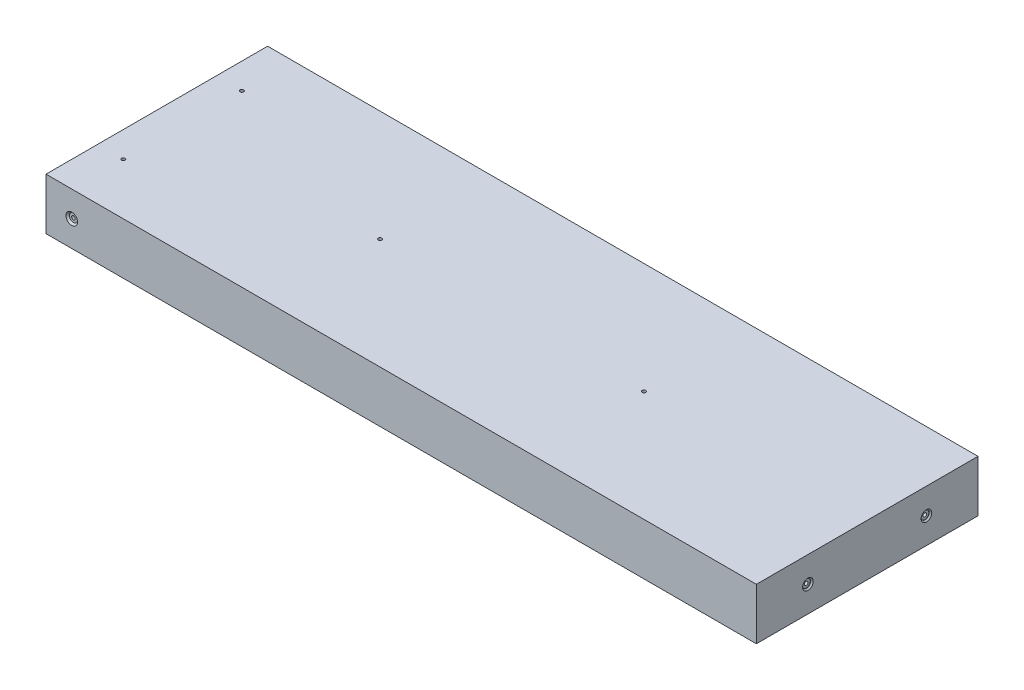
ISO-10303-21;
HEADER;
FILE_DESCRIPTION(('STEP AP214'),'2;1');
FILE_NAME('part.step','',(''),(''),'','','');
FILE_SCHEMA(('AUTOMOTIVE_DESIGN { 1 0 10303 214 1 1 1 1 }'));
ENDSEC;
DATA;
#1=APPLICATION_CONTEXT('core data for automotive mechanical design processes');
#2=APPLICATION_PROTOCOL_DEFINITION('international standard','automotive_design',2000,#1);
#3=PRODUCT_CONTEXT('',#1,'mechanical');
#4=PRODUCT('Part','Part','',(#3));
#5=PRODUCT_RELATED_PRODUCT_CATEGORY('part','',(#4));
#6=PRODUCT_DEFINITION_FORMATION('','',#4);
#7=PRODUCT_DEFINITION_CONTEXT('part definition',#1,'design');
#8=PRODUCT_DEFINITION('design','',#6,#7);
#9=PRODUCT_DEFINITION_SHAPE('','',#8);
#10=(LENGTH_UNIT() NAMED_UNIT(*) SI_UNIT(.MILLI.,.METRE.));
#11=(NAMED_UNIT(*) PLANE_ANGLE_UNIT() SI_UNIT($,.RADIAN.));
#12=(NAMED_UNIT(*) SI_UNIT($,.STERADIAN.) SOLID_ANGLE_UNIT());
#13=UNCERTAINTY_MEASURE_WITH_UNIT(LENGTH_MEASURE(1.E-05),#10,'distance_accuracy_value','');
#14=(GEOMETRIC_REPRESENTATION_CONTEXT(3) GLOBAL_UNCERTAINTY_ASSIGNED_CONTEXT((#13)) GLOBAL_UNIT_ASSIGNED_CONTEXT((#10,
#11,#12)) REPRESENTATION_CONTEXT('',''));
#15=CARTESIAN_POINT('',(0.,0.,0.));
#16=DIRECTION('',(0.,0.,1.));
#17=DIRECTION('',(1.,0.,0.));
#18=AXIS2_PLACEMENT_3D('',#15,#16,#17);
#19=CARTESIAN_POINT('',(-162.3,12.7,-54.6));
#20=DIRECTION('',(0.,0.,-1.));
#21=DIRECTION('',(-1.,0.,0.));
#22=AXIS2_PLACEMENT_3D('',#19,#20,#21);
#23=CYLINDRICAL_SURFACE('',#22,0.889000000000001);
#24=CARTESIAN_POINT('',(-162.3,12.7,-53.7872));
#25=DIRECTION('',(0.,0.,-1.));
#26=DIRECTION('',(-1.,0.,0.));
#27=AXIS2_PLACEMENT_3D('',#24,#25,#26);
#28=CIRCLE('',#27,0.889000000000001);
#29=CARTESIAN_POINT('',(-163.189,12.7,-53.7872));
#30=VERTEX_POINT('',#29);
#31=EDGE_CURVE('E177',#30,#30,#28,.T.);
#32=ORIENTED_EDGE('',*,*,#31,.T.);
#33=EDGE_LOOP('',(#32));
#34=FACE_BOUND('',#33,.T.);
#35=CARTESIAN_POINT('',(-162.3,12.7,-29.2));
#36=DIRECTION('',(0.,0.707106781186547,-0.707106781186547));
#37=DIRECTION('',(0.,-0.707106781186547,-0.707106781186547));
#38=AXIS2_PLACEMENT_3D('',#35,#36,#37);
#39=ELLIPSE('',#38,1.25723585694968,0.889000000000001);
#40=CARTESIAN_POINT('',(-163.189,12.7,-29.2));
#41=VERTEX_POINT('',#40);
#42=CARTESIAN_POINT('',(-161.411,12.7,-29.2));
#43=VERTEX_POINT('',#42);
#44=EDGE_CURVE('E46',#41,#43,#39,.F.);
#45=ORIENTED_EDGE('',*,*,#44,.T.);
#46=CARTESIAN_POINT('',(-162.3,12.7,-29.2));
#47=DIRECTION('',(0.,-0.707106781186547,-0.707106781186547));
#48=DIRECTION('',(0.,0.707106781186547,-0.707106781186547));
#49=AXIS2_PLACEMENT_3D('',#46,#47,#48);
#50=ELLIPSE('',#49,1.25723585694968,0.889000000000001);
#51=EDGE_CURVE('E11',#43,#41,#50,.F.);
#52=ORIENTED_EDGE('',*,*,#51,.T.);
#53=EDGE_LOOP('',(#45,#52));
#54=FACE_BOUND('',#53,.T.);
#55=ADVANCED_FACE('F33',(#34,#54),#23,.F.);
#56=CARTESIAN_POINT('',(-162.3,12.7,54.6));
#57=DIRECTION('',(0.,0.,1.));
#58=DIRECTION('',(1.,0.,0.));
#59=AXIS2_PLACEMENT_3D('',#56,#57,#58);
#60=CYLINDRICAL_SURFACE('',#59,0.889000000000001);
#61=CARTESIAN_POINT('',(-162.3,12.7,53.7872));
#62=DIRECTION('',(0.,0.,1.));
#63=DIRECTION('',(1.,0.,0.));
#64=AXIS2_PLACEMENT_3D('',#61,#62,#63);
#65=CIRCLE('',#64,0.889000000000001);
#66=CARTESIAN_POINT('',(-161.411,12.7,53.7872));
#67=VERTEX_POINT('',#66);
#68=EDGE_CURVE('E162',#67,#67,#65,.T.);
#69=ORIENTED_EDGE('',*,*,#68,.T.);
#70=EDGE_LOOP('',(#69));
#71=FACE_BOUND('',#70,.T.);
#72=CARTESIAN_POINT('',(-162.3,12.7,29.2));
#73=DIRECTION('',(0.,0.707106781186547,0.707106781186547));
#74=DIRECTION('',(0.,-0.707106781186547,0.707106781186547));
#75=AXIS2_PLACEMENT_3D('',#72,#73,#74);
#76=ELLIPSE('',#75,1.25723585694968,0.889000000000001);
#77=CARTESIAN_POINT('',(-161.411,12.7,29.2));
#78=VERTEX_POINT('',#77);
#79=CARTESIAN_POINT('',(-163.189,12.7,29.2));
#80=VERTEX_POINT('',#79);
#81=EDGE_CURVE('E53',#78,#80,#76,.F.);
#82=ORIENTED_EDGE('',*,*,#81,.T.);
#83=CARTESIAN_POINT('',(-162.3,12.7,29.2));
#84=DIRECTION('',(0.,-0.707106781186547,0.707106781186547));
#85=DIRECTION('',(0.,0.707106781186547,0.707106781186547));
#86=AXIS2_PLACEMENT_3D('',#83,#84,#85);
#87=ELLIPSE('',#86,1.25723585694968,0.889000000000001);
#88=EDGE_CURVE('E106',#80,#78,#87,.F.);
#89=ORIENTED_EDGE('',*,*,#88,.T.);
#90=EDGE_LOOP('',(#82,#89));
#91=FACE_BOUND('',#90,.T.);
#92=ADVANCED_FACE('F313',(#71,#91),#60,.F.);
#93=CARTESIAN_POINT('',(175.,25.4,-54.6));
#94=DIRECTION('',(-1.,0.,0.));
#95=DIRECTION('',(0.,0.,1.));
#96=AXIS2_PLACEMENT_3D('',#93,#94,#95);
#97=PLANE('',#96);
#98=CARTESIAN_POINT('',(175.,12.7,29.1995));
#99=DIRECTION('',(1.,0.,0.));
#100=DIRECTION('',(0.,0.,-1.));
#101=AXIS2_PLACEMENT_3D('',#98,#99,#100);
#102=CIRCLE('',#101,2.62001);
#103=CARTESIAN_POINT('',(175.,12.7,26.57949));
#104=VERTEX_POINT('',#103);
#105=EDGE_CURVE('E128',#104,#104,#102,.T.);
#106=ORIENTED_EDGE('',*,*,#105,.F.);
#107=EDGE_LOOP('',(#106));
#108=FACE_BOUND('',#107,.T.);
#109=CARTESIAN_POINT('',(175.,12.7,-29.2005));
#110=DIRECTION('',(1.,0.,0.));
#111=DIRECTION('',(0.,0.,-1.));
#112=AXIS2_PLACEMENT_3D('',#109,#110,#111);
#113=CIRCLE('',#112,2.62001);
#114=CARTESIAN_POINT('',(175.,12.7,-31.82051));
#115=VERTEX_POINT('',#114);
#116=EDGE_CURVE('E201',#115,#115,#113,.T.);
#117=ORIENTED_EDGE('',*,*,#116,.F.);
#118=EDGE_LOOP('',(#117));
#119=FACE_BOUND('',#118,.T.);
#120=DIRECTION('',(0.,0.,-1.));
#121=VECTOR('',#120,1.);
#122=CARTESIAN_POINT('',(175.,0.,-54.6));
#123=LINE('',#122,#121);
#124=CARTESIAN_POINT('',(175.,0.,54.6));
#125=VERTEX_POINT('',#124);
#126=CARTESIAN_POINT('',(175.,0.,-54.6));
#127=VERTEX_POINT('',#126);
#128=EDGE_CURVE('E149',#125,#127,#123,.T.);
#129=ORIENTED_EDGE('',*,*,#128,.T.);
#130=DIRECTION('',(0.,-1.,0.));
#131=VECTOR('',#130,1.);
#132=CARTESIAN_POINT('',(175.,25.4,-54.6));
#133=LINE('',#132,#131);
#134=CARTESIAN_POINT('',(175.,25.4,-54.6));
#135=VERTEX_POINT('',#134);
#136=EDGE_CURVE('E119',#135,#127,#133,.T.);
#137=ORIENTED_EDGE('',*,*,#136,.F.);
#138=DIRECTION('',(0.,0.,-1.));
#139=VECTOR('',#138,1.);
#140=CARTESIAN_POINT('',(175.,25.4,-54.6));
#141=LINE('',#140,#139);
#142=CARTESIAN_POINT('',(175.,25.4,54.6));
#143=VERTEX_POINT('',#142);
#144=EDGE_CURVE('E144',#143,#135,#141,.T.);
#145=ORIENTED_EDGE('',*,*,#144,.F.);
#146=DIRECTION('',(0.,-1.,0.));
#147=VECTOR('',#146,1.);
#148=CARTESIAN_POINT('',(175.,25.4,54.6));
#149=LINE('',#148,#147);
#150=EDGE_CURVE('E138',#143,#125,#149,.T.);
#151=ORIENTED_EDGE('',*,*,#150,.T.);
#152=EDGE_LOOP('',(#129,#137,#145,#151));
#153=FACE_BOUND('',#152,.T.);
#154=ADVANCED_FACE('F35',(#108,#119,#153),#97,.F.);
#155=CARTESIAN_POINT('',(-175.,25.4,-54.6));
#156=DIRECTION('',(0.,0.,1.));
#157=DIRECTION('',(1.,0.,0.));
#158=AXIS2_PLACEMENT_3D('',#155,#156,#157);
#159=PLANE('',#158);
#160=CARTESIAN_POINT('',(-162.3,12.7,-54.6));
#161=DIRECTION('',(0.,0.,-1.));
#162=DIRECTION('',(-1.,0.,0.));
#163=AXIS2_PLACEMENT_3D('',#160,#161,#162);
#164=CIRCLE('',#163,2.85750000000001);
#165=CARTESIAN_POINT('',(-165.1575,12.7,-54.6));
#166=VERTEX_POINT('',#165);
#167=EDGE_CURVE('E186',#166,#166,#164,.T.);
#168=ORIENTED_EDGE('',*,*,#167,.F.);
#169=EDGE_LOOP('',(#168));
#170=FACE_BOUND('',#169,.T.);
#171=DIRECTION('',(-1.,0.,0.));
#172=VECTOR('',#171,1.);
#173=CARTESIAN_POINT('',(-175.,0.,-54.6));
#174=LINE('',#173,#172);
#175=CARTESIAN_POINT('',(-175.,0.,-54.6));
#176=VERTEX_POINT('',#175);
#177=EDGE_CURVE('E147',#127,#176,#174,.T.);
#178=ORIENTED_EDGE('',*,*,#177,.T.);
#179=DIRECTION('',(0.,-1.,0.));
#180=VECTOR('',#179,1.);
#181=CARTESIAN_POINT('',(-175.,25.4,-54.6));
#182=LINE('',#181,#180);
#183=CARTESIAN_POINT('',(-175.,25.4,-54.6));
#184=VERTEX_POINT('',#183);
#185=EDGE_CURVE('E132',#184,#176,#182,.T.);
#186=ORIENTED_EDGE('',*,*,#185,.F.);
#187=DIRECTION('',(-1.,0.,0.));
#188=VECTOR('',#187,1.);
#189=CARTESIAN_POINT('',(-175.,25.4,-54.6));
#190=LINE('',#189,#188);
#191=EDGE_CURVE('E156',#135,#184,#190,.T.);
#192=ORIENTED_EDGE('',*,*,#191,.F.);
#193=ORIENTED_EDGE('',*,*,#136,.T.);
#194=EDGE_LOOP('',(#178,#186,#192,#193));
#195=FACE_BOUND('',#194,.T.);
#196=ADVANCED_FACE('F300',(#170,#195),#159,.F.);
#197=CARTESIAN_POINT('',(-175.,25.4,-54.6));
#198=DIRECTION('',(1.,0.,0.));
#199=DIRECTION('',(0.,0.,-1.));
#200=AXIS2_PLACEMENT_3D('',#197,#198,#199);
#201=PLANE('',#200);
#202=DIRECTION('',(0.,0.,1.));
#203=VECTOR('',#202,1.);
#204=CARTESIAN_POINT('',(-175.,0.,-54.6));
#205=LINE('',#204,#203);
#206=CARTESIAN_POINT('',(-175.,0.,54.6));
#207=VERTEX_POINT('',#206);
#208=EDGE_CURVE('E145',#176,#207,#205,.T.);
#209=ORIENTED_EDGE('',*,*,#208,.T.);
#210=DIRECTION('',(0.,-1.,0.));
#211=VECTOR('',#210,1.);
#212=CARTESIAN_POINT('',(-175.,25.4,54.6));
#213=LINE('',#212,#211);
#214=CARTESIAN_POINT('',(-175.,25.4,54.6));
#215=VERTEX_POINT('',#214);
#216=EDGE_CURVE('E135',#215,#207,#213,.T.);
#217=ORIENTED_EDGE('',*,*,#216,.F.);
#218=DIRECTION('',(0.,0.,1.));
#219=VECTOR('',#218,1.);
#220=CARTESIAN_POINT('',(-175.,25.4,-54.6));
#221=LINE('',#220,#219);
#222=EDGE_CURVE('E154',#184,#215,#221,.T.);
#223=ORIENTED_EDGE('',*,*,#222,.F.);
#224=ORIENTED_EDGE('',*,*,#185,.T.);
#225=EDGE_LOOP('',(#209,#217,#223,#224));
#226=FACE_BOUND('',#225,.T.);
#227=ADVANCED_FACE('F297',(#226),#201,.F.);
#228=CARTESIAN_POINT('',(-175.,25.4,54.6));
#229=DIRECTION('',(0.,0.,-1.));
#230=DIRECTION('',(-1.,0.,0.));
#231=AXIS2_PLACEMENT_3D('',#228,#229,#230);
#232=PLANE('',#231);
#233=CARTESIAN_POINT('',(-162.3,12.7,54.6));
#234=DIRECTION('',(0.,0.,1.));
#235=DIRECTION('',(1.,0.,0.));
#236=AXIS2_PLACEMENT_3D('',#233,#234,#235);
#237=CIRCLE('',#236,2.85750000000001);
#238=CARTESIAN_POINT('',(-159.4425,12.7,54.6));
#239=VERTEX_POINT('',#238);
#240=EDGE_CURVE('E171',#239,#239,#237,.T.);
#241=ORIENTED_EDGE('',*,*,#240,.F.);
#242=EDGE_LOOP('',(#241));
#243=FACE_BOUND('',#242,.T.);
#244=DIRECTION('',(1.,0.,0.));
#245=VECTOR('',#244,1.);
#246=CARTESIAN_POINT('',(-175.,0.,54.6));
#247=LINE('',#246,#245);
#248=EDGE_CURVE('E142',#207,#125,#247,.T.);
#249=ORIENTED_EDGE('',*,*,#248,.T.);
#250=ORIENTED_EDGE('',*,*,#150,.F.);
#251=DIRECTION('',(1.,0.,0.));
#252=VECTOR('',#251,1.);
#253=CARTESIAN_POINT('',(-175.,25.4,54.6));
#254=LINE('',#253,#252);
#255=EDGE_CURVE('E141',#215,#143,#254,.T.);
#256=ORIENTED_EDGE('',*,*,#255,.F.);
#257=ORIENTED_EDGE('',*,*,#216,.T.);
#258=EDGE_LOOP('',(#249,#250,#256,#257));
#259=FACE_BOUND('',#258,.T.);
#260=ADVANCED_FACE('F293',(#243,#259),#232,.F.);
#261=CARTESIAN_POINT('',(0.,25.4,0.));
#262=DIRECTION('',(0.,1.,0.));
#263=DIRECTION('',(0.,0.,1.));
#264=AXIS2_PLACEMENT_3D('',#261,#262,#263);
#265=PLANE('',#264);
#266=CARTESIAN_POINT('',(-162.3,25.4,-29.2));
#267=DIRECTION('',(0.,-1.,0.));
#268=DIRECTION('',(0.,0.,-1.));
#269=AXIS2_PLACEMENT_3D('',#266,#267,#268);
#270=CIRCLE('',#269,0.889000000000001);
#271=CARTESIAN_POINT('',(-162.3,25.4,-30.089));
#272=VERTEX_POINT('',#271);
#273=EDGE_CURVE('E254',#272,#272,#270,.T.);
#274=ORIENTED_EDGE('',*,*,#273,.T.);
#275=EDGE_LOOP('',(#274));
#276=FACE_BOUND('',#275,.T.);
#277=CARTESIAN_POINT('',(-162.3,25.4,29.2));
#278=DIRECTION('',(0.,-1.,0.));
#279=DIRECTION('',(0.,0.,-1.));
#280=AXIS2_PLACEMENT_3D('',#277,#278,#279);
#281=CIRCLE('',#280,0.889000000000001);
#282=CARTESIAN_POINT('',(-162.3,25.4,28.311));
#283=VERTEX_POINT('',#282);
#284=EDGE_CURVE('E239',#283,#283,#281,.T.);
#285=ORIENTED_EDGE('',*,*,#284,.T.);
#286=EDGE_LOOP('',(#285));
#287=FACE_BOUND('',#286,.T.);
#288=CARTESIAN_POINT('',(-65.,25.4,0.));
#289=DIRECTION('',(0.,1.,0.));
#290=DIRECTION('',(0.,0.,1.));
#291=AXIS2_PLACEMENT_3D('',#288,#289,#290);
#292=CIRCLE('',#291,0.888999999999987);
#293=CARTESIAN_POINT('',(-65.,25.4,0.888999999999999));
#294=VERTEX_POINT('',#293);
#295=EDGE_CURVE('E120',#294,#294,#292,.T.);
#296=ORIENTED_EDGE('',*,*,#295,.F.);
#297=EDGE_LOOP('',(#296));
#298=FACE_BOUND('',#297,.T.);
#299=CARTESIAN_POINT('',(65.,25.4,0.));
#300=DIRECTION('',(0.,1.,0.));
#301=DIRECTION('',(0.,0.,1.));
#302=AXIS2_PLACEMENT_3D('',#299,#300,#301);
#303=CIRCLE('',#302,0.888999999999987);
#304=CARTESIAN_POINT('',(65.,25.4,0.889000000000015));
#305=VERTEX_POINT('',#304);
#306=EDGE_CURVE('E125',#305,#305,#303,.T.);
#307=ORIENTED_EDGE('',*,*,#306,.F.);
#308=EDGE_LOOP('',(#307));
#309=FACE_BOUND('',#308,.T.);
#310=ORIENTED_EDGE('',*,*,#144,.T.);
#311=ORIENTED_EDGE('',*,*,#191,.T.);
#312=ORIENTED_EDGE('',*,*,#222,.T.);
#313=ORIENTED_EDGE('',*,*,#255,.T.);
#314=EDGE_LOOP('',(#310,#311,#312,#313));
#315=FACE_BOUND('',#314,.T.);
#316=ADVANCED_FACE('F276',(#276,#287,#298,#309,#315),#265,.T.);
#317=CARTESIAN_POINT('',(0.,0.,0.));
#318=DIRECTION('',(0.,1.,0.));
#319=DIRECTION('',(0.,0.,1.));
#320=AXIS2_PLACEMENT_3D('',#317,#318,#319);
#321=PLANE('',#320);
#322=CARTESIAN_POINT('',(-162.3,0.,-29.2));
#323=DIRECTION('',(0.,-1.,0.));
#324=DIRECTION('',(0.,0.,-1.));
#325=AXIS2_PLACEMENT_3D('',#322,#323,#324);
#326=CIRCLE('',#325,2.85750000000001);
#327=CARTESIAN_POINT('',(-162.3,0.,-32.0575));
#328=VERTEX_POINT('',#327);
#329=EDGE_CURVE('E266',#328,#328,#326,.T.);
#330=ORIENTED_EDGE('',*,*,#329,.F.);
#331=EDGE_LOOP('',(#330));
#332=FACE_BOUND('',#331,.T.);
#333=CARTESIAN_POINT('',(-162.3,0.,29.2));
#334=DIRECTION('',(0.,-1.,0.));
#335=DIRECTION('',(0.,0.,-1.));
#336=AXIS2_PLACEMENT_3D('',#333,#334,#335);
#337=CIRCLE('',#336,2.85750000000001);
#338=CARTESIAN_POINT('',(-162.3,0.,26.3425));
#339=VERTEX_POINT('',#338);
#340=EDGE_CURVE('E251',#339,#339,#337,.T.);
#341=ORIENTED_EDGE('',*,*,#340,.F.);
#342=EDGE_LOOP('',(#341));
#343=FACE_BOUND('',#342,.T.);
#344=CARTESIAN_POINT('',(-65.,0.,0.));
#345=DIRECTION('',(0.,-1.,0.));
#346=DIRECTION('',(0.,0.,-1.));
#347=AXIS2_PLACEMENT_3D('',#344,#345,#346);
#348=CIRCLE('',#347,2.8575);
#349=CARTESIAN_POINT('',(-65.,0.,-2.85749999999999));
#350=VERTEX_POINT('',#349);
#351=EDGE_CURVE('E236',#350,#350,#348,.T.);
#352=ORIENTED_EDGE('',*,*,#351,.F.);
#353=EDGE_LOOP('',(#352));
#354=FACE_BOUND('',#353,.T.);
#355=CARTESIAN_POINT('',(65.,0.,0.));
#356=DIRECTION('',(0.,-1.,0.));
#357=DIRECTION('',(0.,0.,-1.));
#358=AXIS2_PLACEMENT_3D('',#355,#356,#357);
#359=CIRCLE('',#358,2.8575);
#360=CARTESIAN_POINT('',(65.,0.,-2.85749999999997));
#361=VERTEX_POINT('',#360);
#362=EDGE_CURVE('E123',#361,#361,#359,.T.);
#363=ORIENTED_EDGE('',*,*,#362,.F.);
#364=EDGE_LOOP('',(#363));
#365=FACE_BOUND('',#364,.T.);
#366=ORIENTED_EDGE('',*,*,#128,.F.);
#367=ORIENTED_EDGE('',*,*,#248,.F.);
#368=ORIENTED_EDGE('',*,*,#208,.F.);
#369=ORIENTED_EDGE('',*,*,#177,.F.);
#370=EDGE_LOOP('',(#366,#367,#368,#369));
#371=FACE_BOUND('',#370,.T.);
#372=ADVANCED_FACE('F272',(#332,#343,#354,#365,#371),#321,.F.);
#373=CARTESIAN_POINT('',(-161.411,12.7,53.7872));
#374=DIRECTION('',(0.,0.,-1.));
#375=DIRECTION('',(-1.,0.,0.));
#376=AXIS2_PLACEMENT_3D('',#373,#374,#375);
#377=PLANE('',#376);
#378=ORIENTED_EDGE('',*,*,#68,.F.);
#379=EDGE_LOOP('',(#378));
#380=FACE_BOUND('',#379,.T.);
#381=CARTESIAN_POINT('',(-162.3,12.7,53.7872));
#382=DIRECTION('',(0.,0.,1.));
#383=DIRECTION('',(1.,0.,0.));
#384=AXIS2_PLACEMENT_3D('',#381,#382,#383);
#385=CIRCLE('',#384,1.98501000000001);
#386=CARTESIAN_POINT('',(-160.31499,12.7,53.7872));
#387=VERTEX_POINT('',#386);
#388=EDGE_CURVE('E165',#387,#387,#385,.T.);
#389=ORIENTED_EDGE('',*,*,#388,.T.);
#390=EDGE_LOOP('',(#389));
#391=FACE_BOUND('',#390,.T.);
#392=ADVANCED_FACE('F275',(#380,#391),#377,.F.);
#393=CARTESIAN_POINT('',(-162.3,12.7,54.6));
#394=DIRECTION('',(0.,0.,1.));
#395=DIRECTION('',(1.,0.,0.));
#396=AXIS2_PLACEMENT_3D('',#393,#394,#395);
#397=CYLINDRICAL_SURFACE('',#396,1.98501000000001);
#398=ORIENTED_EDGE('',*,*,#388,.F.);
#399=EDGE_LOOP('',(#398));
#400=FACE_BOUND('',#399,.T.);
#401=CARTESIAN_POINT('',(-162.3,12.7,53.72751));
#402=DIRECTION('',(0.,0.,1.));
#403=DIRECTION('',(1.,0.,0.));
#404=AXIS2_PLACEMENT_3D('',#401,#402,#403);
#405=CIRCLE('',#404,1.98501000000001);
#406=CARTESIAN_POINT('',(-160.31499,12.7,53.72751));
#407=VERTEX_POINT('',#406);
#408=EDGE_CURVE('E168',#407,#407,#405,.T.);
#409=ORIENTED_EDGE('',*,*,#408,.T.);
#410=EDGE_LOOP('',(#409));
#411=FACE_BOUND('',#410,.T.);
#412=ADVANCED_FACE('F344',(#400,#411),#397,.T.);
#413=CARTESIAN_POINT('',(-162.3,12.7,54.6));
#414=DIRECTION('',(0.,0.,1.));
#415=DIRECTION('',(1.,0.,0.));
#416=AXIS2_PLACEMENT_3D('',#413,#414,#415);
#417=CONICAL_SURFACE('',#416,2.85750000000001,0.785398163397448);
#418=ORIENTED_EDGE('',*,*,#408,.F.);
#419=EDGE_LOOP('',(#418));
#420=FACE_BOUND('',#419,.T.);
#421=ORIENTED_EDGE('',*,*,#240,.T.);
#422=EDGE_LOOP('',(#421));
#423=FACE_BOUND('',#422,.T.);
#424=ADVANCED_FACE('F340',(#420,#423),#417,.F.);
#425=CARTESIAN_POINT('',(-161.411,12.7,-53.7872));
#426=DIRECTION('',(0.,0.,1.));
#427=DIRECTION('',(1.,0.,0.));
#428=AXIS2_PLACEMENT_3D('',#425,#426,#427);
#429=PLANE('',#428);
#430=ORIENTED_EDGE('',*,*,#31,.F.);
#431=EDGE_LOOP('',(#430));
#432=FACE_BOUND('',#431,.T.);
#433=CARTESIAN_POINT('',(-162.3,12.7,-53.7872));
#434=DIRECTION('',(0.,0.,-1.));
#435=DIRECTION('',(-1.,0.,0.));
#436=AXIS2_PLACEMENT_3D('',#433,#434,#435);
#437=CIRCLE('',#436,1.98501000000001);
#438=CARTESIAN_POINT('',(-164.28501,12.7,-53.7872));
#439=VERTEX_POINT('',#438);
#440=EDGE_CURVE('E180',#439,#439,#437,.T.);
#441=ORIENTED_EDGE('',*,*,#440,.T.);
#442=EDGE_LOOP('',(#441));
#443=FACE_BOUND('',#442,.T.);
#444=ADVANCED_FACE('F343',(#432,#443),#429,.F.);
#445=CARTESIAN_POINT('',(-162.3,12.7,-54.6));
#446=DIRECTION('',(0.,0.,-1.));
#447=DIRECTION('',(-1.,0.,0.));
#448=AXIS2_PLACEMENT_3D('',#445,#446,#447);
#449=CYLINDRICAL_SURFACE('',#448,1.98501000000001);
#450=ORIENTED_EDGE('',*,*,#440,.F.);
#451=EDGE_LOOP('',(#450));
#452=FACE_BOUND('',#451,.T.);
#453=CARTESIAN_POINT('',(-162.3,12.7,-53.72751));
#454=DIRECTION('',(0.,0.,-1.));
#455=DIRECTION('',(-1.,0.,0.));
#456=AXIS2_PLACEMENT_3D('',#453,#454,#455);
#457=CIRCLE('',#456,1.98501000000001);
#458=CARTESIAN_POINT('',(-164.28501,12.7,-53.72751));
#459=VERTEX_POINT('',#458);
#460=EDGE_CURVE('E183',#459,#459,#457,.T.);
#461=ORIENTED_EDGE('',*,*,#460,.T.);
#462=EDGE_LOOP('',(#461));
#463=FACE_BOUND('',#462,.T.);
#464=ADVANCED_FACE('F465',(#452,#463),#449,.T.);
#465=CARTESIAN_POINT('',(-162.3,12.7,-54.6));
#466=DIRECTION('',(0.,0.,-1.));
#467=DIRECTION('',(-1.,0.,0.));
#468=AXIS2_PLACEMENT_3D('',#465,#466,#467);
#469=CONICAL_SURFACE('',#468,2.85750000000001,0.785398163397448);
#470=ORIENTED_EDGE('',*,*,#460,.F.);
#471=EDGE_LOOP('',(#470));
#472=FACE_BOUND('',#471,.T.);
#473=ORIENTED_EDGE('',*,*,#167,.T.);
#474=EDGE_LOOP('',(#473));
#475=FACE_BOUND('',#474,.T.);
#476=ADVANCED_FACE('F461',(#472,#475),#469,.F.);
#477=CARTESIAN_POINT('',(145.,12.7,-29.2005));
#478=DIRECTION('',(1.,0.,0.));
#479=DIRECTION('',(0.,0.,-1.));
#480=AXIS2_PLACEMENT_3D('',#477,#478,#479);
#481=CONICAL_SURFACE('',#480,0.888999999999992,1.02974425867664);
#482=CARTESIAN_POINT('',(144.465834909685,12.7,-29.2005));
#483=VERTEX_POINT('',#482);
#484=VERTEX_LOOP('',#483);
#485=FACE_BOUND('',#484,.T.);
#486=CARTESIAN_POINT('',(145.,12.7,-29.2005));
#487=DIRECTION('',(1.,0.,0.));
#488=DIRECTION('',(0.,0.,-1.));
#489=AXIS2_PLACEMENT_3D('',#486,#487,#488);
#490=CIRCLE('',#489,0.888999999999992);
#491=CARTESIAN_POINT('',(145.,12.7,-30.0895));
#492=VERTEX_POINT('',#491);
#493=EDGE_CURVE('E189',#492,#492,#490,.T.);
#494=ORIENTED_EDGE('',*,*,#493,.T.);
#495=EDGE_LOOP('',(#494));
#496=FACE_BOUND('',#495,.T.);
#497=ADVANCED_FACE('F457',(#485,#496),#481,.F.);
#498=CARTESIAN_POINT('',(175.,12.7,-29.2005));
#499=DIRECTION('',(1.,0.,0.));
#500=DIRECTION('',(0.,0.,-1.));
#501=AXIS2_PLACEMENT_3D('',#498,#499,#500);
#502=CYLINDRICAL_SURFACE('',#501,0.888999999999994);
#503=ORIENTED_EDGE('',*,*,#493,.F.);
#504=EDGE_LOOP('',(#503));
#505=FACE_BOUND('',#504,.T.);
#506=CARTESIAN_POINT('',(174.1872,12.7,-29.2005));
#507=DIRECTION('',(1.,0.,0.));
#508=DIRECTION('',(0.,0.,-1.));
#509=AXIS2_PLACEMENT_3D('',#506,#507,#508);
#510=CIRCLE('',#509,0.888999999999996);
#511=CARTESIAN_POINT('',(174.1872,12.7,-30.0895));
#512=VERTEX_POINT('',#511);
#513=EDGE_CURVE('E192',#512,#512,#510,.T.);
#514=ORIENTED_EDGE('',*,*,#513,.T.);
#515=EDGE_LOOP('',(#514));
#516=FACE_BOUND('',#515,.T.);
#517=ADVANCED_FACE('F453',(#505,#516),#502,.F.);
#518=CARTESIAN_POINT('',(174.1872,13.589,-29.2005));
#519=DIRECTION('',(-1.,0.,0.));
#520=DIRECTION('',(0.,0.,1.));
#521=AXIS2_PLACEMENT_3D('',#518,#519,#520);
#522=PLANE('',#521);
#523=ORIENTED_EDGE('',*,*,#513,.F.);
#524=EDGE_LOOP('',(#523));
#525=FACE_BOUND('',#524,.T.);
#526=CARTESIAN_POINT('',(174.1872,12.7,-29.2005));
#527=DIRECTION('',(1.,0.,0.));
#528=DIRECTION('',(0.,0.,-1.));
#529=AXIS2_PLACEMENT_3D('',#526,#527,#528);
#530=CIRCLE('',#529,1.98501);
#531=CARTESIAN_POINT('',(174.1872,12.7,-31.18551));
#532=VERTEX_POINT('',#531);
#533=EDGE_CURVE('E195',#532,#532,#530,.T.);
#534=ORIENTED_EDGE('',*,*,#533,.T.);
#535=EDGE_LOOP('',(#534));
#536=FACE_BOUND('',#535,.T.);
#537=ADVANCED_FACE('F449',(#525,#536),#522,.F.);
#538=CARTESIAN_POINT('',(175.,12.7,-29.2005));
#539=DIRECTION('',(1.,0.,0.));
#540=DIRECTION('',(0.,0.,-1.));
#541=AXIS2_PLACEMENT_3D('',#538,#539,#540);
#542=CYLINDRICAL_SURFACE('',#541,1.98501);
#543=ORIENTED_EDGE('',*,*,#533,.F.);
#544=EDGE_LOOP('',(#543));
#545=FACE_BOUND('',#544,.T.);
#546=CARTESIAN_POINT('',(174.365,12.7,-29.2005));
#547=DIRECTION('',(1.,0.,0.));
#548=DIRECTION('',(0.,0.,-1.));
#549=AXIS2_PLACEMENT_3D('',#546,#547,#548);
#550=CIRCLE('',#549,1.98501);
#551=CARTESIAN_POINT('',(174.365,12.7,-31.18551));
#552=VERTEX_POINT('',#551);
#553=EDGE_CURVE('E198',#552,#552,#550,.T.);
#554=ORIENTED_EDGE('',*,*,#553,.T.);
#555=EDGE_LOOP('',(#554));
#556=FACE_BOUND('',#555,.T.);
#557=ADVANCED_FACE('F445',(#545,#556),#542,.F.);
#558=CARTESIAN_POINT('',(175.,12.7,-29.2005));
#559=DIRECTION('',(1.,0.,0.));
#560=DIRECTION('',(0.,0.,-1.));
#561=AXIS2_PLACEMENT_3D('',#558,#559,#560);
#562=CONICAL_SURFACE('',#561,2.62001,0.785398163397451);
#563=ORIENTED_EDGE('',*,*,#553,.F.);
#564=EDGE_LOOP('',(#563));
#565=FACE_BOUND('',#564,.T.);
#566=ORIENTED_EDGE('',*,*,#116,.T.);
#567=EDGE_LOOP('',(#566));
#568=FACE_BOUND('',#567,.T.);
#569=ADVANCED_FACE('F441',(#565,#568),#562,.F.);
#570=CARTESIAN_POINT('',(145.,12.7,29.1995));
#571=DIRECTION('',(1.,0.,0.));
#572=DIRECTION('',(0.,0.,-1.));
#573=AXIS2_PLACEMENT_3D('',#570,#571,#572);
#574=CONICAL_SURFACE('',#573,0.888999999999992,1.02974425867664);
#575=CARTESIAN_POINT('',(144.465834909685,12.7,29.1995));
#576=VERTEX_POINT('',#575);
#577=VERTEX_LOOP('',#576);
#578=FACE_BOUND('',#577,.T.);
#579=CARTESIAN_POINT('',(145.,12.7,29.1995));
#580=DIRECTION('',(1.,0.,0.));
#581=DIRECTION('',(0.,0.,-1.));
#582=AXIS2_PLACEMENT_3D('',#579,#580,#581);
#583=CIRCLE('',#582,0.888999999999992);
#584=CARTESIAN_POINT('',(145.,12.7,28.3105));
#585=VERTEX_POINT('',#584);
#586=EDGE_CURVE('E204',#585,#585,#583,.T.);
#587=ORIENTED_EDGE('',*,*,#586,.T.);
#588=EDGE_LOOP('',(#587));
#589=FACE_BOUND('',#588,.T.);
#590=ADVANCED_FACE('F437',(#578,#589),#574,.F.);
#591=CARTESIAN_POINT('',(175.,12.7,29.1995));
#592=DIRECTION('',(1.,0.,0.));
#593=DIRECTION('',(0.,0.,-1.));
#594=AXIS2_PLACEMENT_3D('',#591,#592,#593);
#595=CYLINDRICAL_SURFACE('',#594,0.888999999999994);
#596=ORIENTED_EDGE('',*,*,#586,.F.);
#597=EDGE_LOOP('',(#596));
#598=FACE_BOUND('',#597,.T.);
#599=CARTESIAN_POINT('',(174.1872,12.7,29.1995));
#600=DIRECTION('',(1.,0.,0.));
#601=DIRECTION('',(0.,0.,-1.));
#602=AXIS2_PLACEMENT_3D('',#599,#600,#601);
#603=CIRCLE('',#602,0.888999999999996);
#604=CARTESIAN_POINT('',(174.1872,12.7,28.3105));
#605=VERTEX_POINT('',#604);
#606=EDGE_CURVE('E207',#605,#605,#603,.T.);
#607=ORIENTED_EDGE('',*,*,#606,.T.);
#608=EDGE_LOOP('',(#607));
#609=FACE_BOUND('',#608,.T.);
#610=ADVANCED_FACE('F433',(#598,#609),#595,.F.);
#611=CARTESIAN_POINT('',(174.1872,13.589,29.1995));
#612=DIRECTION('',(-1.,0.,0.));
#613=DIRECTION('',(0.,0.,1.));
#614=AXIS2_PLACEMENT_3D('',#611,#612,#613);
#615=PLANE('',#614);
#616=ORIENTED_EDGE('',*,*,#606,.F.);
#617=EDGE_LOOP('',(#616));
#618=FACE_BOUND('',#617,.T.);
#619=CARTESIAN_POINT('',(174.1872,12.7,29.1995));
#620=DIRECTION('',(1.,0.,0.));
#621=DIRECTION('',(0.,0.,-1.));
#622=AXIS2_PLACEMENT_3D('',#619,#620,#621);
#623=CIRCLE('',#622,1.98501);
#624=CARTESIAN_POINT('',(174.1872,12.7,27.21449));
#625=VERTEX_POINT('',#624);
#626=EDGE_CURVE('E210',#625,#625,#623,.T.);
#627=ORIENTED_EDGE('',*,*,#626,.T.);
#628=EDGE_LOOP('',(#627));
#629=FACE_BOUND('',#628,.T.);
#630=ADVANCED_FACE('F429',(#618,#629),#615,.F.);
#631=CARTESIAN_POINT('',(175.,12.7,29.1995));
#632=DIRECTION('',(1.,0.,0.));
#633=DIRECTION('',(0.,0.,-1.));
#634=AXIS2_PLACEMENT_3D('',#631,#632,#633);
#635=CYLINDRICAL_SURFACE('',#634,1.98501);
#636=ORIENTED_EDGE('',*,*,#626,.F.);
#637=EDGE_LOOP('',(#636));
#638=FACE_BOUND('',#637,.T.);
#639=CARTESIAN_POINT('',(174.365,12.7,29.1995));
#640=DIRECTION('',(1.,0.,0.));
#641=DIRECTION('',(0.,0.,-1.));
#642=AXIS2_PLACEMENT_3D('',#639,#640,#641);
#643=CIRCLE('',#642,1.98501);
#644=CARTESIAN_POINT('',(174.365,12.7,27.21449));
#645=VERTEX_POINT('',#644);
#646=EDGE_CURVE('E213',#645,#645,#643,.T.);
#647=ORIENTED_EDGE('',*,*,#646,.T.);
#648=EDGE_LOOP('',(#647));
#649=FACE_BOUND('',#648,.T.);
#650=ADVANCED_FACE('F425',(#638,#649),#635,.F.);
#651=CARTESIAN_POINT('',(175.,12.7,29.1995));
#652=DIRECTION('',(1.,0.,0.));
#653=DIRECTION('',(0.,0.,-1.));
#654=AXIS2_PLACEMENT_3D('',#651,#652,#653);
#655=CONICAL_SURFACE('',#654,2.62001,0.785398163397451);
#656=ORIENTED_EDGE('',*,*,#646,.F.);
#657=EDGE_LOOP('',(#656));
#658=FACE_BOUND('',#657,.T.);
#659=ORIENTED_EDGE('',*,*,#105,.T.);
#660=EDGE_LOOP('',(#659));
#661=FACE_BOUND('',#660,.T.);
#662=ADVANCED_FACE('F395',(#658,#661),#655,.F.);
#663=CARTESIAN_POINT('',(65.,0.,0.));
#664=DIRECTION('',(0.,-1.,0.));
#665=DIRECTION('',(0.,0.,-1.));
#666=AXIS2_PLACEMENT_3D('',#663,#664,#665);
#667=CYLINDRICAL_SURFACE('',#666,0.888999999999987);
#668=ORIENTED_EDGE('',*,*,#306,.T.);
#669=EDGE_LOOP('',(#668));
#670=FACE_BOUND('',#669,.T.);
#671=CARTESIAN_POINT('',(65.,0.812799999999996,0.));
#672=DIRECTION('',(0.,-1.,0.));
#673=DIRECTION('',(0.,0.,-1.));
#674=AXIS2_PLACEMENT_3D('',#671,#672,#673);
#675=CIRCLE('',#674,0.888999999999987);
#676=CARTESIAN_POINT('',(65.,0.812799999999996,-0.888999999999959));
#677=VERTEX_POINT('',#676);
#678=EDGE_CURVE('E129',#677,#677,#675,.T.);
#679=ORIENTED_EDGE('',*,*,#678,.T.);
#680=EDGE_LOOP('',(#679));
#681=FACE_BOUND('',#680,.T.);
#682=ADVANCED_FACE('F391',(#670,#681),#667,.F.);
#683=CARTESIAN_POINT('',(65.889,0.812799999999996,0.));
#684=DIRECTION('',(0.,1.,0.));
#685=DIRECTION('',(0.,0.,1.));
#686=AXIS2_PLACEMENT_3D('',#683,#684,#685);
#687=PLANE('',#686);
#688=ORIENTED_EDGE('',*,*,#678,.F.);
#689=EDGE_LOOP('',(#688));
#690=FACE_BOUND('',#689,.T.);
#691=CARTESIAN_POINT('',(65.,0.812799999999996,0.));
#692=DIRECTION('',(0.,-1.,0.));
#693=DIRECTION('',(0.,0.,-1.));
#694=AXIS2_PLACEMENT_3D('',#691,#692,#693);
#695=CIRCLE('',#694,1.98501);
#696=CARTESIAN_POINT('',(65.,0.812799999999996,-1.98500999999997));
#697=VERTEX_POINT('',#696);
#698=EDGE_CURVE('E220',#697,#697,#695,.T.);
#699=ORIENTED_EDGE('',*,*,#698,.T.);
#700=EDGE_LOOP('',(#699));
#701=FACE_BOUND('',#700,.T.);
#702=ADVANCED_FACE('F394',(#690,#701),#687,.F.);
#703=CARTESIAN_POINT('',(65.,0.,0.));
#704=DIRECTION('',(0.,-1.,0.));
#705=DIRECTION('',(0.,0.,-1.));
#706=AXIS2_PLACEMENT_3D('',#703,#704,#705);
#707=CYLINDRICAL_SURFACE('',#706,1.98501);
#708=ORIENTED_EDGE('',*,*,#698,.F.);
#709=EDGE_LOOP('',(#708));
#710=FACE_BOUND('',#709,.T.);
#711=CARTESIAN_POINT('',(65.,0.87249,0.));
#712=DIRECTION('',(0.,-1.,0.));
#713=DIRECTION('',(0.,0.,-1.));
#714=AXIS2_PLACEMENT_3D('',#711,#712,#713);
#715=CIRCLE('',#714,1.98501);
#716=CARTESIAN_POINT('',(65.,0.87249,-1.98500999999997));
#717=VERTEX_POINT('',#716);
#718=EDGE_CURVE('E223',#717,#717,#715,.T.);
#719=ORIENTED_EDGE('',*,*,#718,.T.);
#720=EDGE_LOOP('',(#719));
#721=FACE_BOUND('',#720,.T.);
#722=ADVANCED_FACE('F401',(#710,#721),#707,.T.);
#723=CARTESIAN_POINT('',(65.,0.,0.));
#724=DIRECTION('',(0.,-1.,0.));
#725=DIRECTION('',(0.,0.,-1.));
#726=AXIS2_PLACEMENT_3D('',#723,#724,#725);
#727=CONICAL_SURFACE('',#726,2.8575,0.785398163397449);
#728=ORIENTED_EDGE('',*,*,#718,.F.);
#729=EDGE_LOOP('',(#728));
#730=FACE_BOUND('',#729,.T.);
#731=ORIENTED_EDGE('',*,*,#362,.T.);
#732=EDGE_LOOP('',(#731));
#733=FACE_BOUND('',#732,.T.);
#734=ADVANCED_FACE('F407',(#730,#733),#727,.F.);
#735=CARTESIAN_POINT('',(-65.,0.,0.));
#736=DIRECTION('',(0.,-1.,0.));
#737=DIRECTION('',(0.,0.,-1.));
#738=AXIS2_PLACEMENT_3D('',#735,#736,#737);
#739=CYLINDRICAL_SURFACE('',#738,0.888999999999987);
#740=ORIENTED_EDGE('',*,*,#295,.T.);
#741=EDGE_LOOP('',(#740));
#742=FACE_BOUND('',#741,.T.);
#743=CARTESIAN_POINT('',(-65.,0.812799999999996,0.));
#744=DIRECTION('',(0.,-1.,0.));
#745=DIRECTION('',(0.,0.,-1.));
#746=AXIS2_PLACEMENT_3D('',#743,#744,#745);
#747=CIRCLE('',#746,0.888999999999987);
#748=CARTESIAN_POINT('',(-65.,0.812799999999996,-0.888999999999975));
#749=VERTEX_POINT('',#748);
#750=EDGE_CURVE('E124',#749,#749,#747,.T.);
#751=ORIENTED_EDGE('',*,*,#750,.T.);
#752=EDGE_LOOP('',(#751));
#753=FACE_BOUND('',#752,.T.);
#754=ADVANCED_FACE('F413',(#742,#753),#739,.F.);
#755=CARTESIAN_POINT('',(-64.111,0.812799999999996,0.));
#756=DIRECTION('',(0.,1.,0.));
#757=DIRECTION('',(0.,0.,1.));
#758=AXIS2_PLACEMENT_3D('',#755,#756,#757);
#759=PLANE('',#758);
#760=ORIENTED_EDGE('',*,*,#750,.F.);
#761=EDGE_LOOP('',(#760));
#762=FACE_BOUND('',#761,.T.);
#763=CARTESIAN_POINT('',(-65.,0.812799999999996,0.));
#764=DIRECTION('',(0.,-1.,0.));
#765=DIRECTION('',(0.,0.,-1.));
#766=AXIS2_PLACEMENT_3D('',#763,#764,#765);
#767=CIRCLE('',#766,1.98501);
#768=CARTESIAN_POINT('',(-65.,0.812799999999996,-1.98500999999998));
#769=VERTEX_POINT('',#768);
#770=EDGE_CURVE('E230',#769,#769,#767,.T.);
#771=ORIENTED_EDGE('',*,*,#770,.T.);
#772=EDGE_LOOP('',(#771));
#773=FACE_BOUND('',#772,.T.);
#774=ADVANCED_FACE('F418',(#762,#773),#759,.F.);
#775=CARTESIAN_POINT('',(-65.,0.,0.));
#776=DIRECTION('',(0.,-1.,0.));
#777=DIRECTION('',(0.,0.,-1.));
#778=AXIS2_PLACEMENT_3D('',#775,#776,#777);
#779=CYLINDRICAL_SURFACE('',#778,1.98501);
#780=ORIENTED_EDGE('',*,*,#770,.F.);
#781=EDGE_LOOP('',(#780));
#782=FACE_BOUND('',#781,.T.);
#783=CARTESIAN_POINT('',(-65.,0.87249,0.));
#784=DIRECTION('',(0.,-1.,0.));
#785=DIRECTION('',(0.,0.,-1.));
#786=AXIS2_PLACEMENT_3D('',#783,#784,#785);
#787=CIRCLE('',#786,1.98501);
#788=CARTESIAN_POINT('',(-65.,0.87249,-1.98500999999998));
#789=VERTEX_POINT('',#788);
#790=EDGE_CURVE('E233',#789,#789,#787,.T.);
#791=ORIENTED_EDGE('',*,*,#790,.T.);
#792=EDGE_LOOP('',(#791));
#793=FACE_BOUND('',#792,.T.);
#794=ADVANCED_FACE('F699',(#782,#793),#779,.T.);
#795=CARTESIAN_POINT('',(-65.,0.,0.));
#796=DIRECTION('',(0.,-1.,0.));
#797=DIRECTION('',(0.,0.,-1.));
#798=AXIS2_PLACEMENT_3D('',#795,#796,#797);
#799=CONICAL_SURFACE('',#798,2.8575,0.785398163397449);
#800=ORIENTED_EDGE('',*,*,#790,.F.);
#801=EDGE_LOOP('',(#800));
#802=FACE_BOUND('',#801,.T.);
#803=ORIENTED_EDGE('',*,*,#351,.T.);
#804=EDGE_LOOP('',(#803));
#805=FACE_BOUND('',#804,.T.);
#806=ADVANCED_FACE('F527',(#802,#805),#799,.F.);
#807=CARTESIAN_POINT('',(-162.3,0.,29.2));
#808=DIRECTION('',(0.,-1.,0.));
#809=DIRECTION('',(0.,0.,-1.));
#810=AXIS2_PLACEMENT_3D('',#807,#808,#809);
#811=CONICAL_SURFACE('',#810,2.85750000000001,0.785398163397452);
#812=CARTESIAN_POINT('',(-162.3,0.872489999999994,29.2));
#813=DIRECTION('',(0.,-1.,0.));
#814=DIRECTION('',(0.,0.,-1.));
#815=AXIS2_PLACEMENT_3D('',#812,#813,#814);
#816=CIRCLE('',#815,1.98501000000001);
#817=CARTESIAN_POINT('',(-162.3,0.872489999999994,27.21499));
#818=VERTEX_POINT('',#817);
#819=EDGE_CURVE('E248',#818,#818,#816,.T.);
#820=ORIENTED_EDGE('',*,*,#819,.F.);
#821=EDGE_LOOP('',(#820));
#822=FACE_BOUND('',#821,.T.);
#823=ORIENTED_EDGE('',*,*,#340,.T.);
#824=EDGE_LOOP('',(#823));
#825=FACE_BOUND('',#824,.T.);
#826=ADVANCED_FACE('F522',(#822,#825),#811,.F.);
#827=CARTESIAN_POINT('',(-162.3,0.,29.2));
#828=DIRECTION('',(0.,-1.,0.));
#829=DIRECTION('',(0.,0.,-1.));
#830=AXIS2_PLACEMENT_3D('',#827,#828,#829);
#831=CYLINDRICAL_SURFACE('',#830,1.98501000000001);
#832=CARTESIAN_POINT('',(-162.3,0.812799999999992,29.2));
#833=DIRECTION('',(0.,-1.,0.));
#834=DIRECTION('',(0.,0.,-1.));
#835=AXIS2_PLACEMENT_3D('',#832,#833,#834);
#836=CIRCLE('',#835,1.98501000000001);
#837=CARTESIAN_POINT('',(-162.3,0.812799999999992,27.21499));
#838=VERTEX_POINT('',#837);
#839=EDGE_CURVE('E245',#838,#838,#836,.T.);
#840=ORIENTED_EDGE('',*,*,#839,.F.);
#841=EDGE_LOOP('',(#840));
#842=FACE_BOUND('',#841,.T.);
#843=ORIENTED_EDGE('',*,*,#819,.T.);
#844=EDGE_LOOP('',(#843));
#845=FACE_BOUND('',#844,.T.);
#846=ADVANCED_FACE('F370',(#842,#845),#831,.T.);
#847=CARTESIAN_POINT('',(-160.31499,0.812799999999992,29.2));
#848=DIRECTION('',(0.,1.,0.));
#849=DIRECTION('',(0.,0.,1.));
#850=AXIS2_PLACEMENT_3D('',#847,#848,#849);
#851=PLANE('',#850);
#852=CARTESIAN_POINT('',(-162.3,0.812799999999992,29.2));
#853=DIRECTION('',(0.,-1.,0.));
#854=DIRECTION('',(0.,0.,-1.));
#855=AXIS2_PLACEMENT_3D('',#852,#853,#854);
#856=CIRCLE('',#855,0.889000000000001);
#857=CARTESIAN_POINT('',(-162.3,0.812799999999992,28.311));
#858=VERTEX_POINT('',#857);
#859=EDGE_CURVE('E242',#858,#858,#856,.T.);
#860=ORIENTED_EDGE('',*,*,#859,.F.);
#861=EDGE_LOOP('',(#860));
#862=FACE_BOUND('',#861,.T.);
#863=ORIENTED_EDGE('',*,*,#839,.T.);
#864=EDGE_LOOP('',(#863));
#865=FACE_BOUND('',#864,.T.);
#866=ADVANCED_FACE('F361',(#862,#865),#851,.F.);
#867=CARTESIAN_POINT('',(-162.3,0.,29.2));
#868=DIRECTION('',(0.,-1.,0.));
#869=DIRECTION('',(0.,0.,-1.));
#870=AXIS2_PLACEMENT_3D('',#867,#868,#869);
#871=CYLINDRICAL_SURFACE('',#870,0.889000000000001);
#872=ORIENTED_EDGE('',*,*,#859,.T.);
#873=EDGE_LOOP('',(#872));
#874=FACE_BOUND('',#873,.T.);
#875=ORIENTED_EDGE('',*,*,#81,.F.);
#876=CARTESIAN_POINT('',(-162.3,12.7,29.2));
#877=DIRECTION('',(0.,-0.707106781186547,0.707106781186547));
#878=DIRECTION('',(0.,0.707106781186547,0.707106781186547));
#879=AXIS2_PLACEMENT_3D('',#876,#877,#878);
#880=ELLIPSE('',#879,1.25723585694968,0.889000000000001);
#881=EDGE_CURVE('E112',#80,#78,#880,.T.);
#882=ORIENTED_EDGE('',*,*,#881,.F.);
#883=EDGE_LOOP('',(#875,#882));
#884=FACE_BOUND('',#883,.T.);
#885=ADVANCED_FACE('F356',(#874,#884),#871,.F.);
#886=CARTESIAN_POINT('',(-162.3,12.7,24.6));
#887=DIRECTION('',(0.,0.,1.));
#888=DIRECTION('',(1.,0.,0.));
#889=AXIS2_PLACEMENT_3D('',#886,#887,#888);
#890=CONICAL_SURFACE('',#889,0.889000000000001,1.02974425867665);
#891=CARTESIAN_POINT('',(-162.3,12.7,24.0658349096845));
#892=VERTEX_POINT('',#891);
#893=VERTEX_LOOP('',#892);
#894=FACE_BOUND('',#893,.T.);
#895=CARTESIAN_POINT('',(-162.3,12.7,24.6));
#896=DIRECTION('',(0.,0.,1.));
#897=DIRECTION('',(1.,0.,0.));
#898=AXIS2_PLACEMENT_3D('',#895,#896,#897);
#899=CIRCLE('',#898,0.889000000000001);
#900=CARTESIAN_POINT('',(-161.411,12.7,24.6));
#901=VERTEX_POINT('',#900);
#902=EDGE_CURVE('E152',#901,#901,#899,.T.);
#903=ORIENTED_EDGE('',*,*,#902,.T.);
#904=EDGE_LOOP('',(#903));
#905=FACE_BOUND('',#904,.T.);
#906=ADVANCED_FACE('F353',(#894,#905),#890,.F.);
#907=CARTESIAN_POINT('',(-162.3,12.7,29.2));
#908=DIRECTION('',(0.,0.707106781186547,0.707106781186547));
#909=DIRECTION('',(0.,-0.707106781186547,0.707106781186547));
#910=AXIS2_PLACEMENT_3D('',#907,#908,#909);
#911=ELLIPSE('',#910,1.25723585694968,0.889000000000001);
#912=EDGE_CURVE('E115',#78,#80,#911,.T.);
#913=ORIENTED_EDGE('',*,*,#912,.T.);
#914=ORIENTED_EDGE('',*,*,#881,.T.);
#915=EDGE_LOOP('',(#913,#914));
#916=FACE_BOUND('',#915,.T.);
#917=ORIENTED_EDGE('',*,*,#902,.F.);
#918=EDGE_LOOP('',(#917));
#919=FACE_BOUND('',#918,.T.);
#920=ADVANCED_FACE('F321',(#916,#919),#60,.F.);
#921=ORIENTED_EDGE('',*,*,#284,.F.);
#922=EDGE_LOOP('',(#921));
#923=FACE_BOUND('',#922,.T.);
#924=ORIENTED_EDGE('',*,*,#912,.F.);
#925=ORIENTED_EDGE('',*,*,#88,.F.);
#926=EDGE_LOOP('',(#924,#925));
#927=FACE_BOUND('',#926,.T.);
#928=ADVANCED_FACE('F352',(#923,#927),#871,.F.);
#929=CARTESIAN_POINT('',(-162.3,0.,-29.2));
#930=DIRECTION('',(0.,-1.,0.));
#931=DIRECTION('',(0.,0.,-1.));
#932=AXIS2_PLACEMENT_3D('',#929,#930,#931);
#933=CONICAL_SURFACE('',#932,2.85750000000001,0.785398163397452);
#934=CARTESIAN_POINT('',(-162.3,0.872489999999994,-29.2));
#935=DIRECTION('',(0.,-1.,0.));
#936=DIRECTION('',(0.,0.,-1.));
#937=AXIS2_PLACEMENT_3D('',#934,#935,#936);
#938=CIRCLE('',#937,1.98501000000001);
#939=CARTESIAN_POINT('',(-162.3,0.872489999999994,-31.18501));
#940=VERTEX_POINT('',#939);
#941=EDGE_CURVE('E263',#940,#940,#938,.T.);
#942=ORIENTED_EDGE('',*,*,#941,.F.);
#943=EDGE_LOOP('',(#942));
#944=FACE_BOUND('',#943,.T.);
#945=ORIENTED_EDGE('',*,*,#329,.T.);
#946=EDGE_LOOP('',(#945));
#947=FACE_BOUND('',#946,.T.);
#948=ADVANCED_FACE('F270',(#944,#947),#933,.F.);
#949=CARTESIAN_POINT('',(-162.3,0.,-29.2));
#950=DIRECTION('',(0.,-1.,0.));
#951=DIRECTION('',(0.,0.,-1.));
#952=AXIS2_PLACEMENT_3D('',#949,#950,#951);
#953=CYLINDRICAL_SURFACE('',#952,1.98501000000001);
#954=CARTESIAN_POINT('',(-162.3,0.812799999999992,-29.2));
#955=DIRECTION('',(0.,-1.,0.));
#956=DIRECTION('',(0.,0.,-1.));
#957=AXIS2_PLACEMENT_3D('',#954,#955,#956);
#958=CIRCLE('',#957,1.98501000000001);
#959=CARTESIAN_POINT('',(-162.3,0.812799999999992,-31.18501));
#960=VERTEX_POINT('',#959);
#961=EDGE_CURVE('E260',#960,#960,#958,.T.);
#962=ORIENTED_EDGE('',*,*,#961,.F.);
#963=EDGE_LOOP('',(#962));
#964=FACE_BOUND('',#963,.T.);
#965=ORIENTED_EDGE('',*,*,#941,.T.);
#966=EDGE_LOOP('',(#965));
#967=FACE_BOUND('',#966,.T.);
#968=ADVANCED_FACE('F380',(#964,#967),#953,.T.);
#969=CARTESIAN_POINT('',(-160.31499,0.812799999999992,-29.2));
#970=DIRECTION('',(0.,1.,0.));
#971=DIRECTION('',(0.,0.,1.));
#972=AXIS2_PLACEMENT_3D('',#969,#970,#971);
#973=PLANE('',#972);
#974=CARTESIAN_POINT('',(-162.3,0.812799999999992,-29.2));
#975=DIRECTION('',(0.,-1.,0.));
#976=DIRECTION('',(0.,0.,-1.));
#977=AXIS2_PLACEMENT_3D('',#974,#975,#976);
#978=CIRCLE('',#977,0.889000000000001);
#979=CARTESIAN_POINT('',(-162.3,0.812799999999992,-30.089));
#980=VERTEX_POINT('',#979);
#981=EDGE_CURVE('E257',#980,#980,#978,.T.);
#982=ORIENTED_EDGE('',*,*,#981,.F.);
#983=EDGE_LOOP('',(#982));
#984=FACE_BOUND('',#983,.T.);
#985=ORIENTED_EDGE('',*,*,#961,.T.);
#986=EDGE_LOOP('',(#985));
#987=FACE_BOUND('',#986,.T.);
#988=ADVANCED_FACE('F336',(#984,#987),#973,.F.);
#989=CARTESIAN_POINT('',(-162.3,0.,-29.2));
#990=DIRECTION('',(0.,-1.,0.));
#991=DIRECTION('',(0.,0.,-1.));
#992=AXIS2_PLACEMENT_3D('',#989,#990,#991);
#993=CYLINDRICAL_SURFACE('',#992,0.889000000000001);
#994=ORIENTED_EDGE('',*,*,#981,.T.);
#995=EDGE_LOOP('',(#994));
#996=FACE_BOUND('',#995,.T.);
#997=ORIENTED_EDGE('',*,*,#44,.F.);
#998=CARTESIAN_POINT('',(-162.3,12.7,-29.2));
#999=DIRECTION('',(0.,-0.707106781186547,-0.707106781186547));
#1000=DIRECTION('',(0.,0.707106781186547,-0.707106781186547));
#1001=AXIS2_PLACEMENT_3D('',#998,#999,#1000);
#1002=ELLIPSE('',#1001,1.25723585694968,0.889000000000001);
#1003=EDGE_CURVE('E41',#43,#41,#1002,.T.);
#1004=ORIENTED_EDGE('',*,*,#1003,.F.);
#1005=EDGE_LOOP('',(#997,#1004));
#1006=FACE_BOUND('',#1005,.T.);
#1007=ADVANCED_FACE('F105',(#996,#1006),#993,.F.);
#1008=CARTESIAN_POINT('',(-162.3,12.7,-24.6));
#1009=DIRECTION('',(0.,0.,-1.));
#1010=DIRECTION('',(-1.,0.,0.));
#1011=AXIS2_PLACEMENT_3D('',#1008,#1009,#1010);
#1012=CONICAL_SURFACE('',#1011,0.889000000000001,1.02974425867665);
#1013=CARTESIAN_POINT('',(-162.3,12.7,-24.0658349096845));
#1014=VERTEX_POINT('',#1013);
#1015=VERTEX_LOOP('',#1014);
#1016=FACE_BOUND('',#1015,.T.);
#1017=CARTESIAN_POINT('',(-162.3,12.7,-24.6));
#1018=DIRECTION('',(0.,0.,-1.));
#1019=DIRECTION('',(-1.,0.,0.));
#1020=AXIS2_PLACEMENT_3D('',#1017,#1018,#1019);
#1021=CIRCLE('',#1020,0.889000000000001);
#1022=CARTESIAN_POINT('',(-163.189,12.7,-24.6));
#1023=VERTEX_POINT('',#1022);
#1024=EDGE_CURVE('E174',#1023,#1023,#1021,.T.);
#1025=ORIENTED_EDGE('',*,*,#1024,.T.);
#1026=EDGE_LOOP('',(#1025));
#1027=FACE_BOUND('',#1026,.T.);
#1028=ADVANCED_FACE('F325',(#1016,#1027),#1012,.F.);
#1029=CARTESIAN_POINT('',(-162.3,12.7,-29.2));
#1030=DIRECTION('',(0.,0.707106781186547,-0.707106781186547));
#1031=DIRECTION('',(0.,-0.707106781186547,-0.707106781186547));
#1032=AXIS2_PLACEMENT_3D('',#1029,#1030,#1031);
#1033=ELLIPSE('',#1032,1.25723585694968,0.889000000000001);
#1034=EDGE_CURVE('E99',#41,#43,#1033,.T.);
#1035=ORIENTED_EDGE('',*,*,#1034,.T.);
#1036=ORIENTED_EDGE('',*,*,#1003,.T.);
#1037=EDGE_LOOP('',(#1035,#1036));
#1038=FACE_BOUND('',#1037,.T.);
#1039=ORIENTED_EDGE('',*,*,#1024,.F.);
#1040=EDGE_LOOP('',(#1039));
#1041=FACE_BOUND('',#1040,.T.);
#1042=ADVANCED_FACE('F108',(#1038,#1041),#23,.F.);
#1043=ORIENTED_EDGE('',*,*,#273,.F.);
#1044=EDGE_LOOP('',(#1043));
#1045=FACE_BOUND('',#1044,.T.);
#1046=ORIENTED_EDGE('',*,*,#1034,.F.);
#1047=ORIENTED_EDGE('',*,*,#51,.F.);
#1048=EDGE_LOOP('',(#1046,#1047));
#1049=FACE_BOUND('',#1048,.T.);
#1050=ADVANCED_FACE('F100',(#1045,#1049),#993,.F.);
#1051=CLOSED_SHELL('',(#55,#92,#154,#196,#227,#260,#316,#372,#392,#412,#424,#444,#464,#476,#497,
#517,#537,#557,#569,#590,#610,#630,#650,#662,#682,#702,#722,#734,#754,#774,#794,#806,#826,#846,
#866,#885,#906,#920,#928,#948,#968,#988,#1007,#1028,#1042,#1050));
#1052=MANIFOLD_SOLID_BREP('B2',#1051);
#1053=ADVANCED_BREP_SHAPE_REPRESENTATION('',(#18,#1052),#14);
#1054=SHAPE_DEFINITION_REPRESENTATION(#9,#1053);
ENDSEC;
END-ISO-10303-21;
